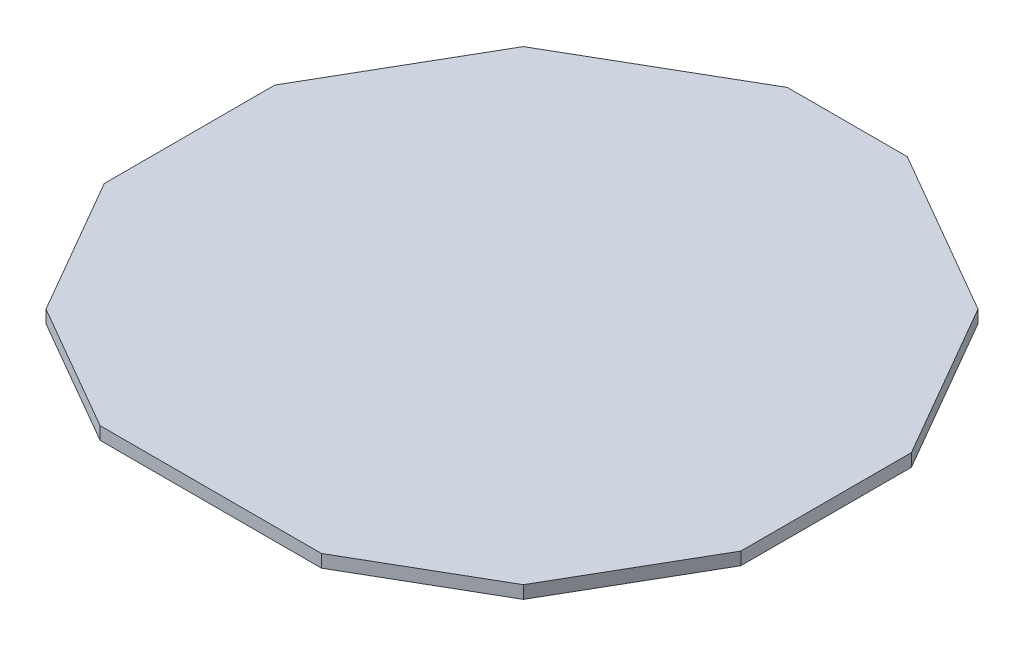
ISO-10303-21;
HEADER;
FILE_DESCRIPTION(('STEP AP214'),'2;1');
FILE_NAME('part.step','',(''),(''),'','','');
FILE_SCHEMA(('AUTOMOTIVE_DESIGN { 1 0 10303 214 1 1 1 1 }'));
ENDSEC;
DATA;
#1=APPLICATION_CONTEXT('core data for automotive mechanical design processes');
#2=APPLICATION_PROTOCOL_DEFINITION('international standard','automotive_design',2000,#1);
#3=PRODUCT_CONTEXT('',#1,'mechanical');
#4=PRODUCT('Part','Part','',(#3));
#5=PRODUCT_RELATED_PRODUCT_CATEGORY('part','',(#4));
#6=PRODUCT_DEFINITION_FORMATION('','',#4);
#7=PRODUCT_DEFINITION_CONTEXT('part definition',#1,'design');
#8=PRODUCT_DEFINITION('design','',#6,#7);
#9=PRODUCT_DEFINITION_SHAPE('','',#8);
#10=(LENGTH_UNIT() NAMED_UNIT(*) SI_UNIT(.MILLI.,.METRE.));
#11=(NAMED_UNIT(*) PLANE_ANGLE_UNIT() SI_UNIT($,.RADIAN.));
#12=(NAMED_UNIT(*) SI_UNIT($,.STERADIAN.) SOLID_ANGLE_UNIT());
#13=UNCERTAINTY_MEASURE_WITH_UNIT(LENGTH_MEASURE(1.E-05),#10,'distance_accuracy_value','');
#14=(GEOMETRIC_REPRESENTATION_CONTEXT(3) GLOBAL_UNCERTAINTY_ASSIGNED_CONTEXT((#13)) GLOBAL_UNIT_ASSIGNED_CONTEXT((#10,
#11,#12)) REPRESENTATION_CONTEXT('',''));
#15=CARTESIAN_POINT('',(0.,0.,0.));
#16=DIRECTION('',(0.,0.,1.));
#17=DIRECTION('',(1.,0.,0.));
#18=AXIS2_PLACEMENT_3D('',#15,#16,#17);
#19=CARTESIAN_POINT('',(14.1666666666667,1.,-24.5373864405591));
#20=DIRECTION('',(0.5,0.,-0.866025403784439));
#21=DIRECTION('',(-0.866025403784439,0.,-0.5));
#22=AXIS2_PLACEMENT_3D('',#19,#20,#21);
#23=PLANE('',#22);
#24=DIRECTION('',(0.866025403784439,0.,0.5));
#25=VECTOR('',#24,1.);
#26=CARTESIAN_POINT('',(14.1666666666667,0.,-24.5373864405591));
#27=LINE('',#26,#25);
#28=CARTESIAN_POINT('',(4.70514243960033,0.,-30.));
#29=VERTEX_POINT('',#28);
#30=CARTESIAN_POINT('',(17.8546882018367,0.,-22.4081062144515));
#31=VERTEX_POINT('',#30);
#32=EDGE_CURVE('E153',#29,#31,#27,.T.);
#33=ORIENTED_EDGE('',*,*,#32,.F.);
#34=DIRECTION('',(0.,-1.,0.));
#35=VECTOR('',#34,1.);
#36=CARTESIAN_POINT('',(4.70514243960033,1.,-30.));
#37=LINE('',#36,#35);
#38=CARTESIAN_POINT('',(4.70514243960033,1.,-30.));
#39=VERTEX_POINT('',#38);
#40=EDGE_CURVE('E11',#39,#29,#37,.T.);
#41=ORIENTED_EDGE('',*,*,#40,.F.);
#42=DIRECTION('',(0.866025403784439,0.,0.5));
#43=VECTOR('',#42,1.);
#44=CARTESIAN_POINT('',(14.1666666666667,1.,-24.5373864405591));
#45=LINE('',#44,#43);
#46=CARTESIAN_POINT('',(17.8546882018367,1.,-22.4081062144515));
#47=VERTEX_POINT('',#46);
#48=EDGE_CURVE('E178',#39,#47,#45,.T.);
#49=ORIENTED_EDGE('',*,*,#48,.T.);
#50=DIRECTION('',(0.,-1.,0.));
#51=VECTOR('',#50,1.);
#52=CARTESIAN_POINT('',(17.8546882018367,1.,-22.4081062144515));
#53=LINE('',#52,#51);
#54=EDGE_CURVE('E100',#47,#31,#53,.T.);
#55=ORIENTED_EDGE('',*,*,#54,.T.);
#56=EDGE_LOOP('',(#33,#41,#49,#55));
#57=FACE_BOUND('',#56,.T.);
#58=ADVANCED_FACE('F37',(#57),#23,.T.);
#59=CARTESIAN_POINT('',(0.,1.,-30.));
#60=DIRECTION('',(0.,0.,-1.));
#61=DIRECTION('',(-1.,0.,0.));
#62=AXIS2_PLACEMENT_3D('',#59,#60,#61);
#63=PLANE('',#62);
#64=DIRECTION('',(1.,0.,0.));
#65=VECTOR('',#64,1.);
#66=CARTESIAN_POINT('',(0.,0.,-30.));
#67=LINE('',#66,#65);
#68=CARTESIAN_POINT('',(-4.70514243960033,0.,-30.));
#69=VERTEX_POINT('',#68);
#70=EDGE_CURVE('E156',#69,#29,#67,.T.);
#71=ORIENTED_EDGE('',*,*,#70,.F.);
#72=DIRECTION('',(0.,-1.,0.));
#73=VECTOR('',#72,1.);
#74=CARTESIAN_POINT('',(-4.70514243960033,1.,-30.));
#75=LINE('',#74,#73);
#76=CARTESIAN_POINT('',(-4.70514243960033,1.,-30.));
#77=VERTEX_POINT('',#76);
#78=EDGE_CURVE('E45',#77,#69,#75,.T.);
#79=ORIENTED_EDGE('',*,*,#78,.F.);
#80=DIRECTION('',(1.,0.,0.));
#81=VECTOR('',#80,1.);
#82=CARTESIAN_POINT('',(0.,1.,-30.));
#83=LINE('',#82,#81);
#84=EDGE_CURVE('E247',#77,#39,#83,.T.);
#85=ORIENTED_EDGE('',*,*,#84,.T.);
#86=ORIENTED_EDGE('',*,*,#40,.T.);
#87=EDGE_LOOP('',(#71,#79,#85,#86));
#88=FACE_BOUND('',#87,.T.);
#89=ADVANCED_FACE('F208',(#88),#63,.T.);
#90=CARTESIAN_POINT('',(-14.1666666666667,1.,-24.5373864405591));
#91=DIRECTION('',(-0.5,0.,-0.866025403784438));
#92=DIRECTION('',(-0.866025403784439,0.,0.5));
#93=AXIS2_PLACEMENT_3D('',#90,#91,#92);
#94=PLANE('',#93);
#95=DIRECTION('',(0.866025403784439,0.,-0.5));
#96=VECTOR('',#95,1.);
#97=CARTESIAN_POINT('',(-14.1666666666667,0.,-24.5373864405591));
#98=LINE('',#97,#96);
#99=CARTESIAN_POINT('',(-17.8546882018367,0.,-22.4081062144515));
#100=VERTEX_POINT('',#99);
#101=EDGE_CURVE('E159',#100,#69,#98,.T.);
#102=ORIENTED_EDGE('',*,*,#101,.F.);
#103=DIRECTION('',(0.,-1.,0.));
#104=VECTOR('',#103,1.);
#105=CARTESIAN_POINT('',(-17.8546882018367,1.,-22.4081062144515));
#106=LINE('',#105,#104);
#107=CARTESIAN_POINT('',(-17.8546882018367,1.,-22.4081062144515));
#108=VERTEX_POINT('',#107);
#109=EDGE_CURVE('E197',#108,#100,#106,.T.);
#110=ORIENTED_EDGE('',*,*,#109,.F.);
#111=DIRECTION('',(0.866025403784439,0.,-0.5));
#112=VECTOR('',#111,1.);
#113=CARTESIAN_POINT('',(-14.1666666666667,1.,-24.5373864405591));
#114=LINE('',#113,#112);
#115=EDGE_CURVE('E204',#108,#77,#114,.T.);
#116=ORIENTED_EDGE('',*,*,#115,.T.);
#117=ORIENTED_EDGE('',*,*,#78,.T.);
#118=EDGE_LOOP('',(#102,#110,#116,#117));
#119=FACE_BOUND('',#118,.T.);
#120=ADVANCED_FACE('F202',(#119),#94,.T.);
#121=CARTESIAN_POINT('',(-23.094010767585,1.,-13.3333333333333));
#122=DIRECTION('',(0.866025403784439,0.,0.5));
#123=DIRECTION('',(0.5,0.,-0.866025403784439));
#124=AXIS2_PLACEMENT_3D('',#121,#122,#123);
#125=PLANE('',#124);
#126=DIRECTION('',(-0.5,0.,0.866025403784439));
#127=VECTOR('',#126,1.);
#128=CARTESIAN_POINT('',(-23.094010767585,0.,-13.3333333333333));
#129=LINE('',#128,#127);
#130=CARTESIAN_POINT('',(-25.,0.,-10.0320631441114));
#131=VERTEX_POINT('',#130);
#132=EDGE_CURVE('E162',#100,#131,#129,.T.);
#133=ORIENTED_EDGE('',*,*,#132,.T.);
#134=DIRECTION('',(0.,-1.,0.));
#135=VECTOR('',#134,1.);
#136=CARTESIAN_POINT('',(-25.,1.,-10.0320631441114));
#137=LINE('',#136,#135);
#138=CARTESIAN_POINT('',(-25.,1.,-10.0320631441114));
#139=VERTEX_POINT('',#138);
#140=EDGE_CURVE('E194',#139,#131,#137,.T.);
#141=ORIENTED_EDGE('',*,*,#140,.F.);
#142=DIRECTION('',(-0.5,0.,0.866025403784439));
#143=VECTOR('',#142,1.);
#144=CARTESIAN_POINT('',(-23.094010767585,1.,-13.3333333333333));
#145=LINE('',#144,#143);
#146=EDGE_CURVE('E225',#108,#139,#145,.T.);
#147=ORIENTED_EDGE('',*,*,#146,.F.);
#148=ORIENTED_EDGE('',*,*,#109,.T.);
#149=EDGE_LOOP('',(#133,#141,#147,#148));
#150=FACE_BOUND('',#149,.T.);
#151=ADVANCED_FACE('F216',(#150),#125,.F.);
#152=CARTESIAN_POINT('',(-25.,1.,0.));
#153=DIRECTION('',(1.,0.,0.));
#154=DIRECTION('',(0.,0.,-1.));
#155=AXIS2_PLACEMENT_3D('',#152,#153,#154);
#156=PLANE('',#155);
#157=DIRECTION('',(0.,0.,1.));
#158=VECTOR('',#157,1.);
#159=CARTESIAN_POINT('',(-25.,0.,0.));
#160=LINE('',#159,#158);
#161=CARTESIAN_POINT('',(-25.,0.,3.36539647744479));
#162=VERTEX_POINT('',#161);
#163=EDGE_CURVE('E164',#131,#162,#160,.T.);
#164=ORIENTED_EDGE('',*,*,#163,.T.);
#165=DIRECTION('',(0.,-1.,0.));
#166=VECTOR('',#165,1.);
#167=CARTESIAN_POINT('',(-25.,1.,3.36539647744479));
#168=LINE('',#167,#166);
#169=CARTESIAN_POINT('',(-25.,1.,3.36539647744479));
#170=VERTEX_POINT('',#169);
#171=EDGE_CURVE('E191',#170,#162,#168,.T.);
#172=ORIENTED_EDGE('',*,*,#171,.F.);
#173=DIRECTION('',(0.,0.,1.));
#174=VECTOR('',#173,1.);
#175=CARTESIAN_POINT('',(-25.,1.,0.));
#176=LINE('',#175,#174);
#177=EDGE_CURVE('E222',#139,#170,#176,.T.);
#178=ORIENTED_EDGE('',*,*,#177,.F.);
#179=ORIENTED_EDGE('',*,*,#140,.T.);
#180=EDGE_LOOP('',(#164,#172,#178,#179));
#181=FACE_BOUND('',#180,.T.);
#182=ADVANCED_FACE('F220',(#181),#156,.F.);
#183=CARTESIAN_POINT('',(-20.2072594216369,1.,11.6666666666667));
#184=DIRECTION('',(0.866025403784438,0.,-0.5));
#185=DIRECTION('',(-0.5,0.,-0.866025403784438));
#186=AXIS2_PLACEMENT_3D('',#183,#184,#185);
#187=PLANE('',#186);
#188=DIRECTION('',(0.5,0.,0.866025403784438));
#189=VECTOR('',#188,1.);
#190=CARTESIAN_POINT('',(-20.2072594216369,0.,11.6666666666667));
#191=LINE('',#190,#189);
#192=CARTESIAN_POINT('',(-18.7478521766072,0.,14.1944341639923));
#193=VERTEX_POINT('',#192);
#194=EDGE_CURVE('E166',#162,#193,#191,.T.);
#195=ORIENTED_EDGE('',*,*,#194,.T.);
#196=DIRECTION('',(0.,-1.,0.));
#197=VECTOR('',#196,1.);
#198=CARTESIAN_POINT('',(-18.7478521766072,1.,14.1944341639923));
#199=LINE('',#198,#197);
#200=CARTESIAN_POINT('',(-18.7478521766072,1.,14.1944341639923));
#201=VERTEX_POINT('',#200);
#202=EDGE_CURVE('E188',#201,#193,#199,.T.);
#203=ORIENTED_EDGE('',*,*,#202,.F.);
#204=DIRECTION('',(0.5,0.,0.866025403784438));
#205=VECTOR('',#204,1.);
#206=CARTESIAN_POINT('',(-20.2072594216369,1.,11.6666666666667));
#207=LINE('',#206,#205);
#208=EDGE_CURVE('E224',#170,#201,#207,.T.);
#209=ORIENTED_EDGE('',*,*,#208,.F.);
#210=ORIENTED_EDGE('',*,*,#171,.T.);
#211=EDGE_LOOP('',(#195,#203,#209,#210));
#212=FACE_BOUND('',#211,.T.);
#213=ADVANCED_FACE('F263',(#212),#187,.F.);
#214=CARTESIAN_POINT('',(-10.8333333333333,1.,18.7638837486628));
#215=DIRECTION('',(0.5,0.,-0.866025403784439));
#216=DIRECTION('',(-0.866025403784439,0.,-0.5));
#217=AXIS2_PLACEMENT_3D('',#214,#215,#216);
#218=PLANE('',#217);
#219=DIRECTION('',(0.866025403784439,0.,0.5));
#220=VECTOR('',#219,1.);
#221=CARTESIAN_POINT('',(-10.8333333333333,0.,18.7638837486628));
#222=LINE('',#221,#220);
#223=CARTESIAN_POINT('',(-8.69231718195575,0.,20.));
#224=VERTEX_POINT('',#223);
#225=EDGE_CURVE('E168',#193,#224,#222,.T.);
#226=ORIENTED_EDGE('',*,*,#225,.T.);
#227=DIRECTION('',(0.,-1.,0.));
#228=VECTOR('',#227,1.);
#229=CARTESIAN_POINT('',(-8.69231718195575,1.,20.));
#230=LINE('',#229,#228);
#231=CARTESIAN_POINT('',(-8.69231718195575,1.,20.));
#232=VERTEX_POINT('',#231);
#233=EDGE_CURVE('E185',#232,#224,#230,.T.);
#234=ORIENTED_EDGE('',*,*,#233,.F.);
#235=DIRECTION('',(0.866025403784439,0.,0.5));
#236=VECTOR('',#235,1.);
#237=CARTESIAN_POINT('',(-10.8333333333333,1.,18.7638837486628));
#238=LINE('',#237,#236);
#239=EDGE_CURVE('E227',#201,#232,#238,.T.);
#240=ORIENTED_EDGE('',*,*,#239,.F.);
#241=ORIENTED_EDGE('',*,*,#202,.T.);
#242=EDGE_LOOP('',(#226,#234,#240,#241));
#243=FACE_BOUND('',#242,.T.);
#244=ADVANCED_FACE('F266',(#243),#218,.F.);
#245=CARTESIAN_POINT('',(0.,1.,20.));
#246=DIRECTION('',(0.,0.,-1.));
#247=DIRECTION('',(-1.,0.,0.));
#248=AXIS2_PLACEMENT_3D('',#245,#246,#247);
#249=PLANE('',#248);
#250=DIRECTION('',(1.,0.,0.));
#251=VECTOR('',#250,1.);
#252=CARTESIAN_POINT('',(0.,0.,20.));
#253=LINE('',#252,#251);
#254=CARTESIAN_POINT('',(8.69231718195578,0.,20.));
#255=VERTEX_POINT('',#254);
#256=EDGE_CURVE('E170',#224,#255,#253,.T.);
#257=ORIENTED_EDGE('',*,*,#256,.T.);
#258=DIRECTION('',(0.,-1.,0.));
#259=VECTOR('',#258,1.);
#260=CARTESIAN_POINT('',(8.69231718195578,1.,20.));
#261=LINE('',#260,#259);
#262=CARTESIAN_POINT('',(8.69231718195578,1.,20.));
#263=VERTEX_POINT('',#262);
#264=EDGE_CURVE('E182',#263,#255,#261,.T.);
#265=ORIENTED_EDGE('',*,*,#264,.F.);
#266=DIRECTION('',(1.,0.,0.));
#267=VECTOR('',#266,1.);
#268=CARTESIAN_POINT('',(0.,1.,20.));
#269=LINE('',#268,#267);
#270=EDGE_CURVE('E233',#232,#263,#269,.T.);
#271=ORIENTED_EDGE('',*,*,#270,.F.);
#272=ORIENTED_EDGE('',*,*,#233,.T.);
#273=EDGE_LOOP('',(#257,#265,#271,#272));
#274=FACE_BOUND('',#273,.T.);
#275=ADVANCED_FACE('F239',(#274),#249,.F.);
#276=CARTESIAN_POINT('',(10.8333333333333,1.,18.7638837486628));
#277=DIRECTION('',(-0.5,0.,-0.866025403784438));
#278=DIRECTION('',(-0.866025403784438,0.,0.5));
#279=AXIS2_PLACEMENT_3D('',#276,#277,#278);
#280=PLANE('',#279);
#281=DIRECTION('',(0.866025403784438,0.,-0.5));
#282=VECTOR('',#281,1.);
#283=CARTESIAN_POINT('',(10.8333333333333,0.,18.7638837486628));
#284=LINE('',#283,#282);
#285=CARTESIAN_POINT('',(18.7478521766071,0.,14.1944341639923));
#286=VERTEX_POINT('',#285);
#287=EDGE_CURVE('E172',#255,#286,#284,.T.);
#288=ORIENTED_EDGE('',*,*,#287,.T.);
#289=DIRECTION('',(0.,-1.,0.));
#290=VECTOR('',#289,1.);
#291=CARTESIAN_POINT('',(18.7478521766071,1.,14.1944341639923));
#292=LINE('',#291,#290);
#293=CARTESIAN_POINT('',(18.7478521766071,1.,14.1944341639923));
#294=VERTEX_POINT('',#293);
#295=EDGE_CURVE('E145',#294,#286,#292,.T.);
#296=ORIENTED_EDGE('',*,*,#295,.F.);
#297=DIRECTION('',(0.866025403784438,0.,-0.5));
#298=VECTOR('',#297,1.);
#299=CARTESIAN_POINT('',(10.8333333333333,1.,18.7638837486628));
#300=LINE('',#299,#298);
#301=EDGE_CURVE('E136',#263,#294,#300,.T.);
#302=ORIENTED_EDGE('',*,*,#301,.F.);
#303=ORIENTED_EDGE('',*,*,#264,.T.);
#304=EDGE_LOOP('',(#288,#296,#302,#303));
#305=FACE_BOUND('',#304,.T.);
#306=ADVANCED_FACE('F243',(#305),#280,.F.);
#307=CARTESIAN_POINT('',(20.2072594216369,1.,11.6666666666667));
#308=DIRECTION('',(-0.866025403784439,0.,-0.5));
#309=DIRECTION('',(-0.5,0.,0.866025403784439));
#310=AXIS2_PLACEMENT_3D('',#307,#308,#309);
#311=PLANE('',#310);
#312=DIRECTION('',(0.5,0.,-0.866025403784439));
#313=VECTOR('',#312,1.);
#314=CARTESIAN_POINT('',(20.2072594216369,0.,11.6666666666667));
#315=LINE('',#314,#313);
#316=CARTESIAN_POINT('',(25.,0.,3.36539647744477));
#317=VERTEX_POINT('',#316);
#318=EDGE_CURVE('E144',#286,#317,#315,.T.);
#319=ORIENTED_EDGE('',*,*,#318,.T.);
#320=DIRECTION('',(0.,-1.,0.));
#321=VECTOR('',#320,1.);
#322=CARTESIAN_POINT('',(25.,1.,3.36539647744477));
#323=LINE('',#322,#321);
#324=CARTESIAN_POINT('',(25.,1.,3.36539647744477));
#325=VERTEX_POINT('',#324);
#326=EDGE_CURVE('E141',#325,#317,#323,.T.);
#327=ORIENTED_EDGE('',*,*,#326,.F.);
#328=DIRECTION('',(0.5,0.,-0.866025403784439));
#329=VECTOR('',#328,1.);
#330=CARTESIAN_POINT('',(20.2072594216369,1.,11.6666666666667));
#331=LINE('',#330,#329);
#332=EDGE_CURVE('E130',#294,#325,#331,.T.);
#333=ORIENTED_EDGE('',*,*,#332,.F.);
#334=ORIENTED_EDGE('',*,*,#295,.T.);
#335=EDGE_LOOP('',(#319,#327,#333,#334));
#336=FACE_BOUND('',#335,.T.);
#337=ADVANCED_FACE('F142',(#336),#311,.F.);
#338=CARTESIAN_POINT('',(25.,1.,0.));
#339=DIRECTION('',(-1.,0.,0.));
#340=DIRECTION('',(0.,0.,1.));
#341=AXIS2_PLACEMENT_3D('',#338,#339,#340);
#342=PLANE('',#341);
#343=DIRECTION('',(0.,0.,-1.));
#344=VECTOR('',#343,1.);
#345=CARTESIAN_POINT('',(25.,0.,0.));
#346=LINE('',#345,#344);
#347=CARTESIAN_POINT('',(25.,0.,-10.0320631441114));
#348=VERTEX_POINT('',#347);
#349=EDGE_CURVE('E93',#317,#348,#346,.T.);
#350=ORIENTED_EDGE('',*,*,#349,.T.);
#351=DIRECTION('',(0.,-1.,0.));
#352=VECTOR('',#351,1.);
#353=CARTESIAN_POINT('',(25.,1.,-10.0320631441114));
#354=LINE('',#353,#352);
#355=CARTESIAN_POINT('',(25.,1.,-10.0320631441114));
#356=VERTEX_POINT('',#355);
#357=EDGE_CURVE('E146',#356,#348,#354,.T.);
#358=ORIENTED_EDGE('',*,*,#357,.F.);
#359=DIRECTION('',(0.,0.,-1.));
#360=VECTOR('',#359,1.);
#361=CARTESIAN_POINT('',(25.,1.,0.));
#362=LINE('',#361,#360);
#363=EDGE_CURVE('E134',#325,#356,#362,.T.);
#364=ORIENTED_EDGE('',*,*,#363,.F.);
#365=ORIENTED_EDGE('',*,*,#326,.T.);
#366=EDGE_LOOP('',(#350,#358,#364,#365));
#367=FACE_BOUND('',#366,.T.);
#368=ADVANCED_FACE('F148',(#367),#342,.F.);
#369=CARTESIAN_POINT('',(23.094010767585,1.,-13.3333333333333));
#370=DIRECTION('',(-0.866025403784438,0.,0.5));
#371=DIRECTION('',(0.5,0.,0.866025403784439));
#372=AXIS2_PLACEMENT_3D('',#369,#370,#371);
#373=PLANE('',#372);
#374=DIRECTION('',(-0.5,0.,-0.866025403784439));
#375=VECTOR('',#374,1.);
#376=CARTESIAN_POINT('',(23.094010767585,0.,-13.3333333333333));
#377=LINE('',#376,#375);
#378=EDGE_CURVE('E176',#348,#31,#377,.T.);
#379=ORIENTED_EDGE('',*,*,#378,.T.);
#380=ORIENTED_EDGE('',*,*,#54,.F.);
#381=DIRECTION('',(-0.5,0.,-0.866025403784439));
#382=VECTOR('',#381,1.);
#383=CARTESIAN_POINT('',(23.094010767585,1.,-13.3333333333333));
#384=LINE('',#383,#382);
#385=EDGE_CURVE('E53',#356,#47,#384,.T.);
#386=ORIENTED_EDGE('',*,*,#385,.F.);
#387=ORIENTED_EDGE('',*,*,#357,.T.);
#388=EDGE_LOOP('',(#379,#380,#386,#387));
#389=FACE_BOUND('',#388,.T.);
#390=ADVANCED_FACE('F246',(#389),#373,.F.);
#391=CARTESIAN_POINT('',(0.,1.,0.));
#392=DIRECTION('',(0.,1.,0.));
#393=DIRECTION('',(0.,0.,1.));
#394=AXIS2_PLACEMENT_3D('',#391,#392,#393);
#395=PLANE('',#394);
#396=ORIENTED_EDGE('',*,*,#48,.F.);
#397=ORIENTED_EDGE('',*,*,#84,.F.);
#398=ORIENTED_EDGE('',*,*,#115,.F.);
#399=ORIENTED_EDGE('',*,*,#146,.T.);
#400=ORIENTED_EDGE('',*,*,#177,.T.);
#401=ORIENTED_EDGE('',*,*,#208,.T.);
#402=ORIENTED_EDGE('',*,*,#239,.T.);
#403=ORIENTED_EDGE('',*,*,#270,.T.);
#404=ORIENTED_EDGE('',*,*,#301,.T.);
#405=ORIENTED_EDGE('',*,*,#332,.T.);
#406=ORIENTED_EDGE('',*,*,#363,.T.);
#407=ORIENTED_EDGE('',*,*,#385,.T.);
#408=EDGE_LOOP('',(#396,#397,#398,#399,#400,#401,#402,#403,#404,#405,#406,#407));
#409=FACE_BOUND('',#408,.T.);
#410=ADVANCED_FACE('F132',(#409),#395,.T.);
#411=CARTESIAN_POINT('',(0.,0.,0.));
#412=DIRECTION('',(0.,1.,0.));
#413=DIRECTION('',(0.,0.,1.));
#414=AXIS2_PLACEMENT_3D('',#411,#412,#413);
#415=PLANE('',#414);
#416=ORIENTED_EDGE('',*,*,#32,.T.);
#417=ORIENTED_EDGE('',*,*,#378,.F.);
#418=ORIENTED_EDGE('',*,*,#349,.F.);
#419=ORIENTED_EDGE('',*,*,#318,.F.);
#420=ORIENTED_EDGE('',*,*,#287,.F.);
#421=ORIENTED_EDGE('',*,*,#256,.F.);
#422=ORIENTED_EDGE('',*,*,#225,.F.);
#423=ORIENTED_EDGE('',*,*,#194,.F.);
#424=ORIENTED_EDGE('',*,*,#163,.F.);
#425=ORIENTED_EDGE('',*,*,#132,.F.);
#426=ORIENTED_EDGE('',*,*,#101,.T.);
#427=ORIENTED_EDGE('',*,*,#70,.T.);
#428=EDGE_LOOP('',(#416,#417,#418,#419,#420,#421,#422,#423,#424,#425,#426,#427));
#429=FACE_BOUND('',#428,.T.);
#430=ADVANCED_FACE('F211',(#429),#415,.F.);
#431=CLOSED_SHELL('',(#58,#89,#120,#151,#182,#213,#244,#275,#306,#337,#368,#390,#410,#430));
#432=MANIFOLD_SOLID_BREP('B2',#431);
#433=ADVANCED_BREP_SHAPE_REPRESENTATION('',(#18,#432),#14);
#434=SHAPE_DEFINITION_REPRESENTATION(#9,#433);
ENDSEC;
END-ISO-10303-21;
